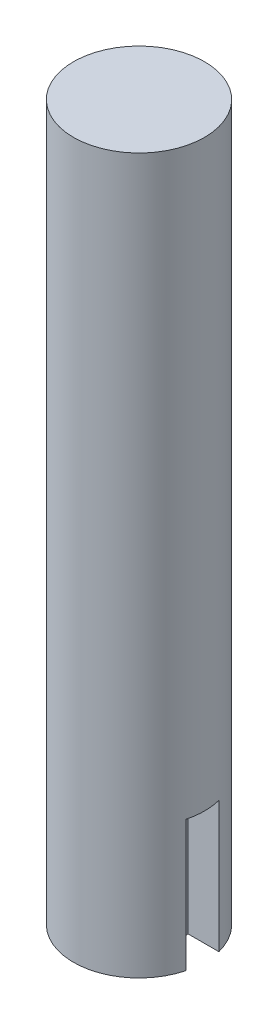
ISO-10303-21;
HEADER;
FILE_DESCRIPTION(('STEP AP214'),'2;1');
FILE_NAME('part.step','',(''),(''),'','','');
FILE_SCHEMA(('AUTOMOTIVE_DESIGN { 1 0 10303 214 1 1 1 1 }'));
ENDSEC;
DATA;
#1=APPLICATION_CONTEXT('core data for automotive mechanical design processes');
#2=APPLICATION_PROTOCOL_DEFINITION('international standard','automotive_design',2000,#1);
#3=PRODUCT_CONTEXT('',#1,'mechanical');
#4=PRODUCT('Part','Part','',(#3));
#5=PRODUCT_RELATED_PRODUCT_CATEGORY('part','',(#4));
#6=PRODUCT_DEFINITION_FORMATION('','',#4);
#7=PRODUCT_DEFINITION_CONTEXT('part definition',#1,'design');
#8=PRODUCT_DEFINITION('design','',#6,#7);
#9=PRODUCT_DEFINITION_SHAPE('','',#8);
#10=(LENGTH_UNIT() NAMED_UNIT(*) SI_UNIT(.MILLI.,.METRE.));
#11=(NAMED_UNIT(*) PLANE_ANGLE_UNIT() SI_UNIT($,.RADIAN.));
#12=(NAMED_UNIT(*) SI_UNIT($,.STERADIAN.) SOLID_ANGLE_UNIT());
#13=UNCERTAINTY_MEASURE_WITH_UNIT(LENGTH_MEASURE(1.E-05),#10,'distance_accuracy_value','');
#14=(GEOMETRIC_REPRESENTATION_CONTEXT(3) GLOBAL_UNCERTAINTY_ASSIGNED_CONTEXT((#13)) GLOBAL_UNIT_ASSIGNED_CONTEXT((#10,
#11,#12)) REPRESENTATION_CONTEXT('',''));
#15=CARTESIAN_POINT('',(0.,0.,0.));
#16=DIRECTION('',(0.,0.,1.));
#17=DIRECTION('',(1.,0.,0.));
#18=AXIS2_PLACEMENT_3D('',#15,#16,#17);
#19=CARTESIAN_POINT('',(0.,109.,0.));
#20=DIRECTION('',(0.,-1.,0.));
#21=DIRECTION('',(0.,0.,-1.));
#22=AXIS2_PLACEMENT_3D('',#19,#20,#21);
#23=CYLINDRICAL_SURFACE('',#22,10.);
#24=CARTESIAN_POINT('',(0.,109.,0.));
#25=DIRECTION('',(0.,1.,0.));
#26=DIRECTION('',(0.,0.,1.));
#27=AXIS2_PLACEMENT_3D('',#24,#25,#26);
#28=CIRCLE('',#27,10.);
#29=CARTESIAN_POINT('',(0.,109.,10.));
#30=VERTEX_POINT('',#29);
#31=EDGE_CURVE('E103',#30,#30,#28,.T.);
#32=ORIENTED_EDGE('',*,*,#31,.F.);
#33=EDGE_LOOP('',(#32));
#34=FACE_BOUND('',#33,.T.);
#35=CARTESIAN_POINT('',(0.,20.,0.));
#36=DIRECTION('',(0.,-1.,0.));
#37=DIRECTION('',(0.,0.,-1.));
#38=AXIS2_PLACEMENT_3D('',#35,#36,#37);
#39=CIRCLE('',#38,10.);
#40=CARTESIAN_POINT('',(9.68245836551854,20.,-2.5));
#41=VERTEX_POINT('',#40);
#42=CARTESIAN_POINT('',(9.68245836551854,20.,2.5));
#43=VERTEX_POINT('',#42);
#44=EDGE_CURVE('E11',#41,#43,#39,.T.);
#45=ORIENTED_EDGE('',*,*,#44,.F.);
#46=DIRECTION('',(0.,-1.,0.));
#47=VECTOR('',#46,1.);
#48=CARTESIAN_POINT('',(9.68245836551854,109.,-2.5));
#49=LINE('',#48,#47);
#50=CARTESIAN_POINT('',(9.68245836551854,0.,-2.5));
#51=VERTEX_POINT('',#50);
#52=EDGE_CURVE('E57',#41,#51,#49,.T.);
#53=ORIENTED_EDGE('',*,*,#52,.T.);
#54=CARTESIAN_POINT('',(0.,0.,0.));
#55=DIRECTION('',(0.,1.,0.));
#56=DIRECTION('',(0.,0.,1.));
#57=AXIS2_PLACEMENT_3D('',#54,#55,#56);
#58=CIRCLE('',#57,10.);
#59=CARTESIAN_POINT('',(9.68245836551854,0.,2.5));
#60=VERTEX_POINT('',#59);
#61=EDGE_CURVE('E102',#51,#60,#58,.T.);
#62=ORIENTED_EDGE('',*,*,#61,.T.);
#63=DIRECTION('',(0.,-1.,0.));
#64=VECTOR('',#63,1.);
#65=CARTESIAN_POINT('',(9.68245836551854,109.,2.5));
#66=LINE('',#65,#64);
#67=EDGE_CURVE('E49',#60,#43,#66,.F.);
#68=ORIENTED_EDGE('',*,*,#67,.T.);
#69=EDGE_LOOP('',(#45,#53,#62,#68));
#70=FACE_BOUND('',#69,.T.);
#71=ADVANCED_FACE('F35',(#34,#70),#23,.T.);
#72=CARTESIAN_POINT('',(0.,109.,0.));
#73=DIRECTION('',(0.,1.,0.));
#74=DIRECTION('',(0.,0.,1.));
#75=AXIS2_PLACEMENT_3D('',#72,#73,#74);
#76=PLANE('',#75);
#77=ORIENTED_EDGE('',*,*,#31,.T.);
#78=EDGE_LOOP('',(#77));
#79=FACE_BOUND('',#78,.T.);
#80=ADVANCED_FACE('F113',(#79),#76,.T.);
#81=CARTESIAN_POINT('',(0.,0.,0.));
#82=DIRECTION('',(0.,1.,0.));
#83=DIRECTION('',(0.,0.,1.));
#84=AXIS2_PLACEMENT_3D('',#81,#82,#83);
#85=PLANE('',#84);
#86=ORIENTED_EDGE('',*,*,#61,.F.);
#87=DIRECTION('',(1.,0.,0.));
#88=VECTOR('',#87,1.);
#89=CARTESIAN_POINT('',(5.,0.,-2.5));
#90=LINE('',#89,#88);
#91=CARTESIAN_POINT('',(5.,0.,-2.5));
#92=VERTEX_POINT('',#91);
#93=EDGE_CURVE('E81',#92,#51,#90,.T.);
#94=ORIENTED_EDGE('',*,*,#93,.F.);
#95=DIRECTION('',(0.,0.,-1.));
#96=VECTOR('',#95,1.);
#97=CARTESIAN_POINT('',(5.,0.,2.5));
#98=LINE('',#97,#96);
#99=CARTESIAN_POINT('',(5.,0.,2.5));
#100=VERTEX_POINT('',#99);
#101=EDGE_CURVE('E96',#100,#92,#98,.T.);
#102=ORIENTED_EDGE('',*,*,#101,.F.);
#103=DIRECTION('',(1.,0.,0.));
#104=VECTOR('',#103,1.);
#105=CARTESIAN_POINT('',(0.,0.,2.5));
#106=LINE('',#105,#104);
#107=EDGE_CURVE('E42',#100,#60,#106,.T.);
#108=ORIENTED_EDGE('',*,*,#107,.T.);
#109=EDGE_LOOP('',(#86,#94,#102,#108));
#110=FACE_BOUND('',#109,.T.);
#111=ADVANCED_FACE('F109',(#110),#85,.F.);
#112=CARTESIAN_POINT('',(0.,20.,0.));
#113=DIRECTION('',(0.,-1.,0.));
#114=DIRECTION('',(0.,0.,-1.));
#115=AXIS2_PLACEMENT_3D('',#112,#113,#114);
#116=PLANE('',#115);
#117=ORIENTED_EDGE('',*,*,#44,.T.);
#118=DIRECTION('',(-1.,0.,0.));
#119=VECTOR('',#118,1.);
#120=CARTESIAN_POINT('',(5.,20.,2.5));
#121=LINE('',#120,#119);
#122=CARTESIAN_POINT('',(5.,20.,2.5));
#123=VERTEX_POINT('',#122);
#124=EDGE_CURVE('E75',#43,#123,#121,.T.);
#125=ORIENTED_EDGE('',*,*,#124,.T.);
#126=DIRECTION('',(0.,0.,-1.));
#127=VECTOR('',#126,1.);
#128=CARTESIAN_POINT('',(5.,20.,2.5));
#129=LINE('',#128,#127);
#130=CARTESIAN_POINT('',(5.,20.,-2.5));
#131=VERTEX_POINT('',#130);
#132=EDGE_CURVE('E79',#123,#131,#129,.T.);
#133=ORIENTED_EDGE('',*,*,#132,.T.);
#134=DIRECTION('',(1.,0.,0.));
#135=VECTOR('',#134,1.);
#136=CARTESIAN_POINT('',(5.,20.,-2.5));
#137=LINE('',#136,#135);
#138=EDGE_CURVE('E90',#131,#41,#137,.T.);
#139=ORIENTED_EDGE('',*,*,#138,.T.);
#140=EDGE_LOOP('',(#117,#125,#133,#139));
#141=FACE_BOUND('',#140,.T.);
#142=ADVANCED_FACE('F77',(#141),#116,.T.);
#143=CARTESIAN_POINT('',(5.,20.,-2.5));
#144=DIRECTION('',(0.,0.,-1.));
#145=DIRECTION('',(-1.,0.,0.));
#146=AXIS2_PLACEMENT_3D('',#143,#144,#145);
#147=PLANE('',#146);
#148=ORIENTED_EDGE('',*,*,#138,.F.);
#149=DIRECTION('',(0.,-1.,0.));
#150=VECTOR('',#149,1.);
#151=CARTESIAN_POINT('',(5.,20.,-2.5));
#152=LINE('',#151,#150);
#153=EDGE_CURVE('E89',#131,#92,#152,.T.);
#154=ORIENTED_EDGE('',*,*,#153,.T.);
#155=ORIENTED_EDGE('',*,*,#93,.T.);
#156=ORIENTED_EDGE('',*,*,#52,.F.);
#157=EDGE_LOOP('',(#148,#154,#155,#156));
#158=FACE_BOUND('',#157,.T.);
#159=ADVANCED_FACE('F127',(#158),#147,.F.);
#160=CARTESIAN_POINT('',(5.,20.,2.5));
#161=DIRECTION('',(0.,0.,1.));
#162=DIRECTION('',(1.,0.,0.));
#163=AXIS2_PLACEMENT_3D('',#160,#161,#162);
#164=PLANE('',#163);
#165=ORIENTED_EDGE('',*,*,#107,.F.);
#166=DIRECTION('',(0.,-1.,0.));
#167=VECTOR('',#166,1.);
#168=CARTESIAN_POINT('',(5.,20.,2.5));
#169=LINE('',#168,#167);
#170=EDGE_CURVE('E84',#123,#100,#169,.T.);
#171=ORIENTED_EDGE('',*,*,#170,.F.);
#172=ORIENTED_EDGE('',*,*,#124,.F.);
#173=ORIENTED_EDGE('',*,*,#67,.F.);
#174=EDGE_LOOP('',(#165,#171,#172,#173));
#175=FACE_BOUND('',#174,.T.);
#176=ADVANCED_FACE('F85',(#175),#164,.F.);
#177=CARTESIAN_POINT('',(5.,20.,2.5));
#178=DIRECTION('',(-1.,0.,0.));
#179=DIRECTION('',(0.,0.,1.));
#180=AXIS2_PLACEMENT_3D('',#177,#178,#179);
#181=PLANE('',#180);
#182=ORIENTED_EDGE('',*,*,#101,.T.);
#183=ORIENTED_EDGE('',*,*,#153,.F.);
#184=ORIENTED_EDGE('',*,*,#132,.F.);
#185=ORIENTED_EDGE('',*,*,#170,.T.);
#186=EDGE_LOOP('',(#182,#183,#184,#185));
#187=FACE_BOUND('',#186,.T.);
#188=ADVANCED_FACE('F92',(#187),#181,.F.);
#189=CLOSED_SHELL('',(#71,#80,#111,#142,#159,#176,#188));
#190=MANIFOLD_SOLID_BREP('B2',#189);
#191=ADVANCED_BREP_SHAPE_REPRESENTATION('',(#18,#190),#14);
#192=SHAPE_DEFINITION_REPRESENTATION(#9,#191);
ENDSEC;
END-ISO-10303-21;
